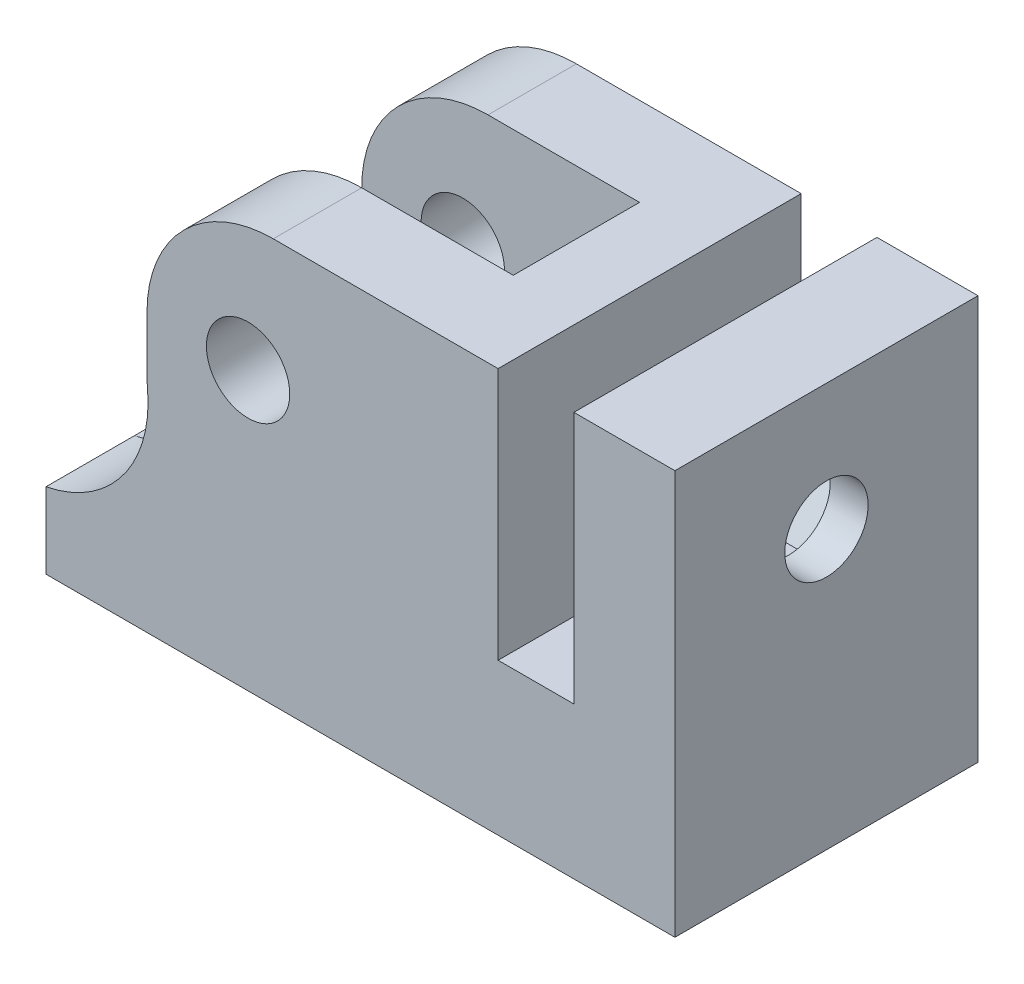
ISO-10303-21;
HEADER;
FILE_DESCRIPTION(('STEP AP214'),'2;1');
FILE_NAME('part.step','',(''),(''),'','','');
FILE_SCHEMA(('AUTOMOTIVE_DESIGN { 1 0 10303 214 1 1 1 1 }'));
ENDSEC;
DATA;
#1=APPLICATION_CONTEXT('core data for automotive mechanical design processes');
#2=APPLICATION_PROTOCOL_DEFINITION('international standard','automotive_design',2000,#1);
#3=PRODUCT_CONTEXT('',#1,'mechanical');
#4=PRODUCT('Part','Part','',(#3));
#5=PRODUCT_RELATED_PRODUCT_CATEGORY('part','',(#4));
#6=PRODUCT_DEFINITION_FORMATION('','',#4);
#7=PRODUCT_DEFINITION_CONTEXT('part definition',#1,'design');
#8=PRODUCT_DEFINITION('design','',#6,#7);
#9=PRODUCT_DEFINITION_SHAPE('','',#8);
#10=(LENGTH_UNIT() NAMED_UNIT(*) SI_UNIT(.MILLI.,.METRE.));
#11=(NAMED_UNIT(*) PLANE_ANGLE_UNIT() SI_UNIT($,.RADIAN.));
#12=(NAMED_UNIT(*) SI_UNIT($,.STERADIAN.) SOLID_ANGLE_UNIT());
#13=UNCERTAINTY_MEASURE_WITH_UNIT(LENGTH_MEASURE(1.E-05),#10,'distance_accuracy_value','');
#14=(GEOMETRIC_REPRESENTATION_CONTEXT(3) GLOBAL_UNCERTAINTY_ASSIGNED_CONTEXT((#13)) GLOBAL_UNIT_ASSIGNED_CONTEXT((#10,
#11,#12)) REPRESENTATION_CONTEXT('',''));
#15=CARTESIAN_POINT('',(0.,0.,0.));
#16=DIRECTION('',(0.,0.,1.));
#17=DIRECTION('',(1.,0.,0.));
#18=AXIS2_PLACEMENT_3D('',#15,#16,#17);
#19=CARTESIAN_POINT('',(-13.9,0.,12.));
#20=DIRECTION('',(1.,0.,0.));
#21=DIRECTION('',(0.,1.,0.));
#22=AXIS2_PLACEMENT_3D('',#19,#20,#21);
#23=PLANE('',#22);
#24=DIRECTION('',(0.,1.,0.));
#25=VECTOR('',#24,1.);
#26=CARTESIAN_POINT('',(-13.9,-16.,8.5));
#27=LINE('',#26,#25);
#28=CARTESIAN_POINT('',(-13.9,-7.18370261164402,8.5));
#29=VERTEX_POINT('',#28);
#30=CARTESIAN_POINT('',(-13.9,-5.,8.5));
#31=VERTEX_POINT('',#30);
#32=EDGE_CURVE('E383',#29,#31,#27,.T.);
#33=ORIENTED_EDGE('',*,*,#32,.F.);
#34=DIRECTION('',(0.,0.,-1.));
#35=VECTOR('',#34,1.);
#36=CARTESIAN_POINT('',(-13.9,-7.18370261164402,12.));
#37=LINE('',#36,#35);
#38=CARTESIAN_POINT('',(-13.9,-7.18370261164402,12.));
#39=VERTEX_POINT('',#38);
#40=EDGE_CURVE('E486',#29,#39,#37,.F.);
#41=ORIENTED_EDGE('',*,*,#40,.T.);
#42=DIRECTION('',(0.,-1.,0.));
#43=VECTOR('',#42,1.);
#44=CARTESIAN_POINT('',(-13.9,0.,12.));
#45=LINE('',#44,#43);
#46=CARTESIAN_POINT('',(-13.9,-5.,12.));
#47=VERTEX_POINT('',#46);
#48=EDGE_CURVE('E407',#47,#39,#45,.T.);
#49=ORIENTED_EDGE('',*,*,#48,.F.);
#50=DIRECTION('',(0.,0.,-1.));
#51=VECTOR('',#50,1.);
#52=CARTESIAN_POINT('',(-13.9,-5.,12.));
#53=LINE('',#52,#51);
#54=EDGE_CURVE('E483',#47,#31,#53,.T.);
#55=ORIENTED_EDGE('',*,*,#54,.T.);
#56=EDGE_LOOP('',(#33,#41,#49,#55));
#57=FACE_BOUND('',#56,.T.);
#58=ADVANCED_FACE('F33',(#57),#23,.F.);
#59=CARTESIAN_POINT('',(-9.9,-5.,12.));
#60=DIRECTION('',(0.,0.,-1.));
#61=DIRECTION('',(-1.,0.,0.));
#62=AXIS2_PLACEMENT_3D('',#59,#60,#61);
#63=CYLINDRICAL_SURFACE('',#62,1.65);
#64=CARTESIAN_POINT('',(-9.9,-5.,8.5));
#65=DIRECTION('',(0.,0.,1.));
#66=DIRECTION('',(1.,0.,0.));
#67=AXIS2_PLACEMENT_3D('',#64,#65,#66);
#68=CIRCLE('',#67,1.65);
#69=CARTESIAN_POINT('',(-8.25,-5.,8.5));
#70=VERTEX_POINT('',#69);
#71=EDGE_CURVE('E392',#70,#70,#68,.T.);
#72=ORIENTED_EDGE('',*,*,#71,.F.);
#73=EDGE_LOOP('',(#72));
#74=FACE_BOUND('',#73,.T.);
#75=CARTESIAN_POINT('',(-9.9,-5.,12.));
#76=DIRECTION('',(0.,0.,1.));
#77=DIRECTION('',(1.,0.,0.));
#78=AXIS2_PLACEMENT_3D('',#75,#76,#77);
#79=CIRCLE('',#78,1.65);
#80=CARTESIAN_POINT('',(-8.25,-5.,12.));
#81=VERTEX_POINT('',#80);
#82=EDGE_CURVE('E393',#81,#81,#79,.T.);
#83=ORIENTED_EDGE('',*,*,#82,.T.);
#84=EDGE_LOOP('',(#83));
#85=FACE_BOUND('',#84,.T.);
#86=ADVANCED_FACE('F611',(#74,#85),#63,.F.);
#87=CARTESIAN_POINT('',(0.,0.,12.));
#88=DIRECTION('',(0.,0.,1.));
#89=DIRECTION('',(1.,0.,0.));
#90=AXIS2_PLACEMENT_3D('',#87,#88,#89);
#91=PLANE('',#90);
#92=CARTESIAN_POINT('',(-8.9,-7.18370261164402,12.));
#93=DIRECTION('',(0.,0.,1.));
#94=DIRECTION('',(1.,0.,0.));
#95=AXIS2_PLACEMENT_3D('',#92,#93,#94);
#96=CIRCLE('',#95,5.);
#97=CARTESIAN_POINT('',(-13.8792979238961,-7.63822674200854,12.));
#98=VERTEX_POINT('',#97);
#99=EDGE_CURVE('E468',#39,#98,#96,.T.);
#100=ORIENTED_EDGE('',*,*,#99,.T.);
#101=CARTESIAN_POINT('',(-18.8585958477923,-8.09275087237306,12.));
#102=DIRECTION('',(0.,0.,1.));
#103=DIRECTION('',(1.,0.,0.));
#104=AXIS2_PLACEMENT_3D('',#101,#102,#103);
#105=CIRCLE('',#104,5.);
#106=CARTESIAN_POINT('',(-17.9,-13.,12.));
#107=VERTEX_POINT('',#106);
#108=EDGE_CURVE('E41',#98,#107,#105,.F.);
#109=ORIENTED_EDGE('',*,*,#108,.T.);
#110=DIRECTION('',(0.,-1.,0.));
#111=VECTOR('',#110,1.);
#112=CARTESIAN_POINT('',(-17.9,-13.,12.));
#113=LINE('',#112,#111);
#114=CARTESIAN_POINT('',(-17.9,-16.,12.));
#115=VERTEX_POINT('',#114);
#116=EDGE_CURVE('E294',#107,#115,#113,.T.);
#117=ORIENTED_EDGE('',*,*,#116,.T.);
#118=DIRECTION('',(1.,0.,0.));
#119=VECTOR('',#118,1.);
#120=CARTESIAN_POINT('',(-4.,-16.,12.));
#121=LINE('',#120,#119);
#122=CARTESIAN_POINT('',(7.,-16.,12.));
#123=VERTEX_POINT('',#122);
#124=EDGE_CURVE('E410',#115,#123,#121,.T.);
#125=ORIENTED_EDGE('',*,*,#124,.T.);
#126=DIRECTION('',(0.,1.,0.));
#127=VECTOR('',#126,1.);
#128=CARTESIAN_POINT('',(7.,-16.,12.));
#129=LINE('',#128,#127);
#130=CARTESIAN_POINT('',(7.,0.,12.));
#131=VERTEX_POINT('',#130);
#132=EDGE_CURVE('E412',#123,#131,#129,.T.);
#133=ORIENTED_EDGE('',*,*,#132,.T.);
#134=DIRECTION('',(-1.,0.,0.));
#135=VECTOR('',#134,1.);
#136=CARTESIAN_POINT('',(7.,0.,12.));
#137=LINE('',#136,#135);
#138=CARTESIAN_POINT('',(3.,0.,12.));
#139=VERTEX_POINT('',#138);
#140=EDGE_CURVE('E414',#131,#139,#137,.T.);
#141=ORIENTED_EDGE('',*,*,#140,.T.);
#142=DIRECTION('',(0.,-1.,0.));
#143=VECTOR('',#142,1.);
#144=CARTESIAN_POINT('',(3.,0.,12.));
#145=LINE('',#144,#143);
#146=CARTESIAN_POINT('',(3.,-10.,12.));
#147=VERTEX_POINT('',#146);
#148=EDGE_CURVE('E416',#139,#147,#145,.T.);
#149=ORIENTED_EDGE('',*,*,#148,.T.);
#150=DIRECTION('',(-1.,0.,0.));
#151=VECTOR('',#150,1.);
#152=CARTESIAN_POINT('',(3.,-10.,12.));
#153=LINE('',#152,#151);
#154=CARTESIAN_POINT('',(0.,-10.,12.));
#155=VERTEX_POINT('',#154);
#156=EDGE_CURVE('E418',#147,#155,#153,.T.);
#157=ORIENTED_EDGE('',*,*,#156,.T.);
#158=DIRECTION('',(0.,1.,0.));
#159=VECTOR('',#158,1.);
#160=CARTESIAN_POINT('',(0.,-10.,12.));
#161=LINE('',#160,#159);
#162=CARTESIAN_POINT('',(0.,0.,12.));
#163=VERTEX_POINT('',#162);
#164=EDGE_CURVE('E400',#155,#163,#161,.T.);
#165=ORIENTED_EDGE('',*,*,#164,.T.);
#166=DIRECTION('',(-1.,0.,0.));
#167=VECTOR('',#166,1.);
#168=CARTESIAN_POINT('',(0.,0.,12.));
#169=LINE('',#168,#167);
#170=CARTESIAN_POINT('',(-8.9,0.,12.));
#171=VERTEX_POINT('',#170);
#172=EDGE_CURVE('E403',#163,#171,#169,.T.);
#173=ORIENTED_EDGE('',*,*,#172,.T.);
#174=CARTESIAN_POINT('',(-8.9,-5.,12.));
#175=DIRECTION('',(0.,0.,1.));
#176=DIRECTION('',(1.,0.,0.));
#177=AXIS2_PLACEMENT_3D('',#174,#175,#176);
#178=CIRCLE('',#177,5.);
#179=EDGE_CURVE('E466',#171,#47,#178,.T.);
#180=ORIENTED_EDGE('',*,*,#179,.T.);
#181=ORIENTED_EDGE('',*,*,#48,.T.);
#182=EDGE_LOOP('',(#100,#109,#117,#125,#133,#141,#149,#157,#165,#173,#180,#181));
#183=FACE_BOUND('',#182,.T.);
#184=ORIENTED_EDGE('',*,*,#82,.F.);
#185=EDGE_LOOP('',(#184));
#186=FACE_BOUND('',#185,.T.);
#187=ADVANCED_FACE('F506',(#183,#186),#91,.T.);
#188=CARTESIAN_POINT('',(0.,0.,0.));
#189=DIRECTION('',(0.,0.,1.));
#190=DIRECTION('',(1.,0.,0.));
#191=AXIS2_PLACEMENT_3D('',#188,#189,#190);
#192=PLANE('',#191);
#193=DIRECTION('',(0.,-1.,0.));
#194=VECTOR('',#193,1.);
#195=CARTESIAN_POINT('',(-5.4,-13.,0.));
#196=LINE('',#195,#194);
#197=CARTESIAN_POINT('',(-5.4,-15.1515151515152,0.));
#198=VERTEX_POINT('',#197);
#199=CARTESIAN_POINT('',(-5.4,-16.,0.));
#200=VERTEX_POINT('',#199);
#201=EDGE_CURVE('E298',#198,#200,#196,.T.);
#202=ORIENTED_EDGE('',*,*,#201,.F.);
#203=DIRECTION('',(0.855197831554018,-0.518301716093344,0.));
#204=VECTOR('',#203,1.);
#205=CARTESIAN_POINT('',(-13.9,-10.,0.));
#206=LINE('',#205,#204);
#207=CARTESIAN_POINT('',(-11.4915085804667,-11.4596917694141,0.));
#208=VERTEX_POINT('',#207);
#209=EDGE_CURVE('E429',#208,#198,#206,.T.);
#210=ORIENTED_EDGE('',*,*,#209,.F.);
#211=CARTESIAN_POINT('',(-8.9,-7.18370261164402,0.));
#212=DIRECTION('',(0.,0.,1.));
#213=DIRECTION('',(1.,0.,0.));
#214=AXIS2_PLACEMENT_3D('',#211,#212,#213);
#215=CIRCLE('',#214,5.);
#216=CARTESIAN_POINT('',(-13.9,-7.18370261164402,0.));
#217=VERTEX_POINT('',#216);
#218=EDGE_CURVE('E473',#208,#217,#215,.F.);
#219=ORIENTED_EDGE('',*,*,#218,.T.);
#220=DIRECTION('',(0.,-1.,0.));
#221=VECTOR('',#220,1.);
#222=CARTESIAN_POINT('',(-13.9,0.,0.));
#223=LINE('',#222,#221);
#224=CARTESIAN_POINT('',(-13.9,-5.,0.));
#225=VERTEX_POINT('',#224);
#226=EDGE_CURVE('E426',#225,#217,#223,.T.);
#227=ORIENTED_EDGE('',*,*,#226,.F.);
#228=CARTESIAN_POINT('',(-8.9,-5.,0.));
#229=DIRECTION('',(0.,0.,1.));
#230=DIRECTION('',(1.,0.,0.));
#231=AXIS2_PLACEMENT_3D('',#228,#229,#230);
#232=CIRCLE('',#231,5.);
#233=CARTESIAN_POINT('',(-8.9,0.,0.));
#234=VERTEX_POINT('',#233);
#235=EDGE_CURVE('E471',#225,#234,#232,.F.);
#236=ORIENTED_EDGE('',*,*,#235,.T.);
#237=DIRECTION('',(-1.,0.,0.));
#238=VECTOR('',#237,1.);
#239=CARTESIAN_POINT('',(0.,0.,0.));
#240=LINE('',#239,#238);
#241=CARTESIAN_POINT('',(0.,0.,0.));
#242=VERTEX_POINT('',#241);
#243=EDGE_CURVE('E423',#242,#234,#240,.T.);
#244=ORIENTED_EDGE('',*,*,#243,.F.);
#245=DIRECTION('',(0.,1.,0.));
#246=VECTOR('',#245,1.);
#247=CARTESIAN_POINT('',(0.,-10.,0.));
#248=LINE('',#247,#246);
#249=CARTESIAN_POINT('',(0.,-10.,0.));
#250=VERTEX_POINT('',#249);
#251=EDGE_CURVE('E396',#250,#242,#248,.T.);
#252=ORIENTED_EDGE('',*,*,#251,.F.);
#253=DIRECTION('',(-1.,0.,0.));
#254=VECTOR('',#253,1.);
#255=CARTESIAN_POINT('',(3.,-10.,0.));
#256=LINE('',#255,#254);
#257=CARTESIAN_POINT('',(3.,-10.,0.));
#258=VERTEX_POINT('',#257);
#259=EDGE_CURVE('E404',#258,#250,#256,.T.);
#260=ORIENTED_EDGE('',*,*,#259,.F.);
#261=DIRECTION('',(0.,-1.,0.));
#262=VECTOR('',#261,1.);
#263=CARTESIAN_POINT('',(3.,0.,0.));
#264=LINE('',#263,#262);
#265=CARTESIAN_POINT('',(3.,0.,0.));
#266=VERTEX_POINT('',#265);
#267=EDGE_CURVE('E438',#266,#258,#264,.T.);
#268=ORIENTED_EDGE('',*,*,#267,.F.);
#269=DIRECTION('',(-1.,0.,0.));
#270=VECTOR('',#269,1.);
#271=CARTESIAN_POINT('',(7.,0.,0.));
#272=LINE('',#271,#270);
#273=CARTESIAN_POINT('',(7.,0.,0.));
#274=VERTEX_POINT('',#273);
#275=EDGE_CURVE('E436',#274,#266,#272,.T.);
#276=ORIENTED_EDGE('',*,*,#275,.F.);
#277=DIRECTION('',(0.,1.,0.));
#278=VECTOR('',#277,1.);
#279=CARTESIAN_POINT('',(7.,-16.,0.));
#280=LINE('',#279,#278);
#281=CARTESIAN_POINT('',(7.,-16.,0.));
#282=VERTEX_POINT('',#281);
#283=EDGE_CURVE('E434',#282,#274,#280,.T.);
#284=ORIENTED_EDGE('',*,*,#283,.F.);
#285=DIRECTION('',(1.,0.,0.));
#286=VECTOR('',#285,1.);
#287=CARTESIAN_POINT('',(-4.,-16.,0.));
#288=LINE('',#287,#286);
#289=EDGE_CURVE('E432',#200,#282,#288,.T.);
#290=ORIENTED_EDGE('',*,*,#289,.F.);
#291=EDGE_LOOP('',(#202,#210,#219,#227,#236,#244,#252,#260,#268,#276,#284,#290));
#292=FACE_BOUND('',#291,.T.);
#293=CARTESIAN_POINT('',(-9.9,-5.,0.));
#294=DIRECTION('',(0.,0.,1.));
#295=DIRECTION('',(1.,0.,0.));
#296=AXIS2_PLACEMENT_3D('',#293,#294,#295);
#297=CIRCLE('',#296,1.65);
#298=CARTESIAN_POINT('',(-8.25,-5.,0.));
#299=VERTEX_POINT('',#298);
#300=EDGE_CURVE('E397',#299,#299,#297,.T.);
#301=ORIENTED_EDGE('',*,*,#300,.T.);
#302=EDGE_LOOP('',(#301));
#303=FACE_BOUND('',#302,.T.);
#304=ADVANCED_FACE('F543',(#292,#303),#192,.F.);
#305=CARTESIAN_POINT('',(0.,-10.,12.));
#306=DIRECTION('',(-1.,0.,0.));
#307=DIRECTION('',(0.,0.,1.));
#308=AXIS2_PLACEMENT_3D('',#305,#306,#307);
#309=PLANE('',#308);
#310=ORIENTED_EDGE('',*,*,#251,.T.);
#311=DIRECTION('',(0.,0.,-1.));
#312=VECTOR('',#311,1.);
#313=CARTESIAN_POINT('',(0.,0.,12.));
#314=LINE('',#313,#312);
#315=EDGE_CURVE('E455',#163,#242,#314,.T.);
#316=ORIENTED_EDGE('',*,*,#315,.F.);
#317=ORIENTED_EDGE('',*,*,#164,.F.);
#318=DIRECTION('',(0.,0.,-1.));
#319=VECTOR('',#318,1.);
#320=CARTESIAN_POINT('',(0.,-10.,12.));
#321=LINE('',#320,#319);
#322=EDGE_CURVE('E420',#155,#250,#321,.T.);
#323=ORIENTED_EDGE('',*,*,#322,.T.);
#324=EDGE_LOOP('',(#310,#316,#317,#323));
#325=FACE_BOUND('',#324,.T.);
#326=ADVANCED_FACE('F588',(#325),#309,.F.);
#327=CARTESIAN_POINT('',(0.,0.,12.));
#328=DIRECTION('',(0.,-1.,0.));
#329=DIRECTION('',(1.,0.,0.));
#330=AXIS2_PLACEMENT_3D('',#327,#328,#329);
#331=PLANE('',#330);
#332=ORIENTED_EDGE('',*,*,#243,.T.);
#333=DIRECTION('',(0.,0.,-1.));
#334=VECTOR('',#333,1.);
#335=CARTESIAN_POINT('',(-8.9,0.,12.));
#336=LINE('',#335,#334);
#337=CARTESIAN_POINT('',(-8.9,0.,3.5));
#338=VERTEX_POINT('',#337);
#339=EDGE_CURVE('E495',#234,#338,#336,.F.);
#340=ORIENTED_EDGE('',*,*,#339,.T.);
#341=DIRECTION('',(-1.,0.,0.));
#342=VECTOR('',#341,1.);
#343=CARTESIAN_POINT('',(-13.9,0.,3.5));
#344=LINE('',#343,#342);
#345=CARTESIAN_POINT('',(-2.9,0.,3.5));
#346=VERTEX_POINT('',#345);
#347=EDGE_CURVE('E373',#346,#338,#344,.T.);
#348=ORIENTED_EDGE('',*,*,#347,.F.);
#349=DIRECTION('',(0.,0.,-1.));
#350=VECTOR('',#349,1.);
#351=CARTESIAN_POINT('',(-2.9,0.,3.5));
#352=LINE('',#351,#350);
#353=CARTESIAN_POINT('',(-2.9,0.,8.5));
#354=VERTEX_POINT('',#353);
#355=EDGE_CURVE('E360',#354,#346,#352,.T.);
#356=ORIENTED_EDGE('',*,*,#355,.F.);
#357=DIRECTION('',(1.,0.,0.));
#358=VECTOR('',#357,1.);
#359=CARTESIAN_POINT('',(-13.9,0.,8.5));
#360=LINE('',#359,#358);
#361=CARTESIAN_POINT('',(-8.9,0.,8.5));
#362=VERTEX_POINT('',#361);
#363=EDGE_CURVE('E376',#362,#354,#360,.T.);
#364=ORIENTED_EDGE('',*,*,#363,.F.);
#365=DIRECTION('',(0.,0.,-1.));
#366=VECTOR('',#365,1.);
#367=CARTESIAN_POINT('',(-8.9,0.,12.));
#368=LINE('',#367,#366);
#369=EDGE_CURVE('E493',#362,#171,#368,.F.);
#370=ORIENTED_EDGE('',*,*,#369,.T.);
#371=ORIENTED_EDGE('',*,*,#172,.F.);
#372=ORIENTED_EDGE('',*,*,#315,.T.);
#373=EDGE_LOOP('',(#332,#340,#348,#356,#364,#370,#371,#372));
#374=FACE_BOUND('',#373,.T.);
#375=ADVANCED_FACE('F526',(#374),#331,.F.);
#376=ORIENTED_EDGE('',*,*,#226,.T.);
#377=DIRECTION('',(0.,0.,-1.));
#378=VECTOR('',#377,1.);
#379=CARTESIAN_POINT('',(-13.9,-7.18370261164402,12.));
#380=LINE('',#379,#378);
#381=CARTESIAN_POINT('',(-13.9,-7.18370261164402,3.5));
#382=VERTEX_POINT('',#381);
#383=EDGE_CURVE('E491',#217,#382,#380,.F.);
#384=ORIENTED_EDGE('',*,*,#383,.T.);
#385=DIRECTION('',(0.,1.,0.));
#386=VECTOR('',#385,1.);
#387=CARTESIAN_POINT('',(-13.9,-16.,3.5));
#388=LINE('',#387,#386);
#389=CARTESIAN_POINT('',(-13.9,-5.,3.5));
#390=VERTEX_POINT('',#389);
#391=EDGE_CURVE('E386',#382,#390,#388,.T.);
#392=ORIENTED_EDGE('',*,*,#391,.T.);
#393=DIRECTION('',(0.,0.,-1.));
#394=VECTOR('',#393,1.);
#395=CARTESIAN_POINT('',(-13.9,-5.,12.));
#396=LINE('',#395,#394);
#397=EDGE_CURVE('E488',#390,#225,#396,.T.);
#398=ORIENTED_EDGE('',*,*,#397,.T.);
#399=EDGE_LOOP('',(#376,#384,#392,#398));
#400=FACE_BOUND('',#399,.T.);
#401=ADVANCED_FACE('F597',(#400),#23,.F.);
#402=CARTESIAN_POINT('',(-13.9,-10.,12.));
#403=DIRECTION('',(0.518301716093344,0.855197831554018,0.));
#404=DIRECTION('',(-0.855197831554018,0.518301716093344,0.));
#405=AXIS2_PLACEMENT_3D('',#402,#403,#404);
#406=PLANE('',#405);
#407=ORIENTED_EDGE('',*,*,#209,.T.);
#408=DIRECTION('',(0.,0.,1.));
#409=VECTOR('',#408,1.);
#410=CARTESIAN_POINT('',(-5.4,-15.1515151515152,12.));
#411=LINE('',#410,#409);
#412=CARTESIAN_POINT('',(-5.4,-15.1515151515152,3.5));
#413=VERTEX_POINT('',#412);
#414=EDGE_CURVE('E313',#198,#413,#411,.T.);
#415=ORIENTED_EDGE('',*,*,#414,.T.);
#416=DIRECTION('',(-0.855197831554018,0.518301716093344,0.));
#417=VECTOR('',#416,1.);
#418=CARTESIAN_POINT('',(-13.9,-10.,3.5));
#419=LINE('',#418,#417);
#420=CARTESIAN_POINT('',(-11.4915085804667,-11.4596917694141,3.5));
#421=VERTEX_POINT('',#420);
#422=EDGE_CURVE('E390',#413,#421,#419,.T.);
#423=ORIENTED_EDGE('',*,*,#422,.T.);
#424=DIRECTION('',(0.,0.,-1.));
#425=VECTOR('',#424,1.);
#426=CARTESIAN_POINT('',(-11.4915085804667,-11.4596917694141,12.));
#427=LINE('',#426,#425);
#428=EDGE_CURVE('E475',#421,#208,#427,.T.);
#429=ORIENTED_EDGE('',*,*,#428,.T.);
#430=EDGE_LOOP('',(#407,#415,#423,#429));
#431=FACE_BOUND('',#430,.T.);
#432=ADVANCED_FACE('F539',(#431),#406,.F.);
#433=CARTESIAN_POINT('',(-4.,-16.,12.));
#434=DIRECTION('',(0.,1.,0.));
#435=DIRECTION('',(0.,0.,1.));
#436=AXIS2_PLACEMENT_3D('',#433,#434,#435);
#437=PLANE('',#436);
#438=ORIENTED_EDGE('',*,*,#124,.F.);
#439=DIRECTION('',(0.,0.,-1.));
#440=VECTOR('',#439,1.);
#441=CARTESIAN_POINT('',(-17.9,-16.,12.));
#442=LINE('',#441,#440);
#443=CARTESIAN_POINT('',(-17.9,-16.,0.));
#444=VERTEX_POINT('',#443);
#445=EDGE_CURVE('E277',#115,#444,#442,.T.);
#446=ORIENTED_EDGE('',*,*,#445,.T.);
#447=DIRECTION('',(1.,0.,0.));
#448=VECTOR('',#447,1.);
#449=CARTESIAN_POINT('',(-17.9,-16.,0.));
#450=LINE('',#449,#448);
#451=CARTESIAN_POINT('',(-14.4,-16.,0.));
#452=VERTEX_POINT('',#451);
#453=EDGE_CURVE('E253',#444,#452,#450,.T.);
#454=ORIENTED_EDGE('',*,*,#453,.T.);
#455=DIRECTION('',(0.,0.,1.));
#456=VECTOR('',#455,1.);
#457=CARTESIAN_POINT('',(-14.4,-16.,0.));
#458=LINE('',#457,#456);
#459=CARTESIAN_POINT('',(-14.4,-16.,4.5));
#460=VERTEX_POINT('',#459);
#461=EDGE_CURVE('E280',#452,#460,#458,.T.);
#462=ORIENTED_EDGE('',*,*,#461,.T.);
#463=CARTESIAN_POINT('',(-14.4,-16.,6.));
#464=DIRECTION('',(0.,1.,0.));
#465=DIRECTION('',(0.,0.,1.));
#466=AXIS2_PLACEMENT_3D('',#463,#464,#465);
#467=CIRCLE('',#466,1.5);
#468=CARTESIAN_POINT('',(-14.4,-16.,7.5));
#469=VERTEX_POINT('',#468);
#470=EDGE_CURVE('E283',#460,#469,#467,.T.);
#471=ORIENTED_EDGE('',*,*,#470,.T.);
#472=DIRECTION('',(1.,0.,0.));
#473=VECTOR('',#472,1.);
#474=CARTESIAN_POINT('',(-14.4,-16.,7.5));
#475=LINE('',#474,#473);
#476=CARTESIAN_POINT('',(-5.4,-16.,7.5));
#477=VERTEX_POINT('',#476);
#478=EDGE_CURVE('E286',#469,#477,#475,.T.);
#479=ORIENTED_EDGE('',*,*,#478,.T.);
#480=CARTESIAN_POINT('',(-5.4,-16.,6.));
#481=DIRECTION('',(0.,1.,0.));
#482=DIRECTION('',(0.,0.,1.));
#483=AXIS2_PLACEMENT_3D('',#480,#481,#482);
#484=CIRCLE('',#483,1.5);
#485=CARTESIAN_POINT('',(-5.4,-16.,4.5));
#486=VERTEX_POINT('',#485);
#487=EDGE_CURVE('E289',#477,#486,#484,.T.);
#488=ORIENTED_EDGE('',*,*,#487,.T.);
#489=DIRECTION('',(0.,0.,-1.));
#490=VECTOR('',#489,1.);
#491=CARTESIAN_POINT('',(-5.4,-16.,4.5));
#492=LINE('',#491,#490);
#493=EDGE_CURVE('E246',#486,#200,#492,.T.);
#494=ORIENTED_EDGE('',*,*,#493,.T.);
#495=ORIENTED_EDGE('',*,*,#289,.T.);
#496=DIRECTION('',(0.,0.,-1.));
#497=VECTOR('',#496,1.);
#498=CARTESIAN_POINT('',(7.,-16.,12.));
#499=LINE('',#498,#497);
#500=EDGE_CURVE('E452',#123,#282,#499,.T.);
#501=ORIENTED_EDGE('',*,*,#500,.F.);
#502=EDGE_LOOP('',(#438,#446,#454,#462,#471,#479,#488,#494,#495,#501));
#503=FACE_BOUND('',#502,.T.);
#504=ADVANCED_FACE('F549',(#503),#437,.F.);
#505=CARTESIAN_POINT('',(7.,-16.,12.));
#506=DIRECTION('',(-1.,0.,0.));
#507=DIRECTION('',(0.,-1.,0.));
#508=AXIS2_PLACEMENT_3D('',#505,#506,#507);
#509=PLANE('',#508);
#510=CARTESIAN_POINT('',(7.,-5.,6.));
#511=DIRECTION('',(-1.,0.,0.));
#512=DIRECTION('',(0.,-1.,0.));
#513=AXIS2_PLACEMENT_3D('',#510,#511,#512);
#514=CIRCLE('',#513,1.65);
#515=CARTESIAN_POINT('',(7.,-6.65,6.));
#516=VERTEX_POINT('',#515);
#517=EDGE_CURVE('E316',#516,#516,#514,.T.);
#518=ORIENTED_EDGE('',*,*,#517,.T.);
#519=EDGE_LOOP('',(#518));
#520=FACE_BOUND('',#519,.T.);
#521=DIRECTION('',(0.,0.,-1.));
#522=VECTOR('',#521,1.);
#523=CARTESIAN_POINT('',(7.,0.,12.));
#524=LINE('',#523,#522);
#525=EDGE_CURVE('E449',#131,#274,#524,.T.);
#526=ORIENTED_EDGE('',*,*,#525,.F.);
#527=ORIENTED_EDGE('',*,*,#132,.F.);
#528=ORIENTED_EDGE('',*,*,#500,.T.);
#529=ORIENTED_EDGE('',*,*,#283,.T.);
#530=EDGE_LOOP('',(#526,#527,#528,#529));
#531=FACE_BOUND('',#530,.T.);
#532=ADVANCED_FACE('F570',(#520,#531),#509,.F.);
#533=CARTESIAN_POINT('',(7.,0.,12.));
#534=DIRECTION('',(0.,-1.,0.));
#535=DIRECTION('',(1.,0.,0.));
#536=AXIS2_PLACEMENT_3D('',#533,#534,#535);
#537=PLANE('',#536);
#538=ORIENTED_EDGE('',*,*,#275,.T.);
#539=DIRECTION('',(0.,0.,-1.));
#540=VECTOR('',#539,1.);
#541=CARTESIAN_POINT('',(3.,0.,12.));
#542=LINE('',#541,#540);
#543=EDGE_CURVE('E446',#139,#266,#542,.T.);
#544=ORIENTED_EDGE('',*,*,#543,.F.);
#545=ORIENTED_EDGE('',*,*,#140,.F.);
#546=ORIENTED_EDGE('',*,*,#525,.T.);
#547=EDGE_LOOP('',(#538,#544,#545,#546));
#548=FACE_BOUND('',#547,.T.);
#549=ADVANCED_FACE('F573',(#548),#537,.F.);
#550=CARTESIAN_POINT('',(3.,0.,12.));
#551=DIRECTION('',(1.,0.,0.));
#552=DIRECTION('',(0.,1.,0.));
#553=AXIS2_PLACEMENT_3D('',#550,#551,#552);
#554=PLANE('',#553);
#555=DIRECTION('',(0.,-0.866025403784439,0.5));
#556=VECTOR('',#555,1.);
#557=CARTESIAN_POINT('',(3.,-5.,2.53589838486224));
#558=LINE('',#557,#556);
#559=CARTESIAN_POINT('',(3.,-5.,2.53589838486225));
#560=VERTEX_POINT('',#559);
#561=CARTESIAN_POINT('',(3.,-8.,4.26794919243112));
#562=VERTEX_POINT('',#561);
#563=EDGE_CURVE('E344',#560,#562,#558,.T.);
#564=ORIENTED_EDGE('',*,*,#563,.F.);
#565=DIRECTION('',(0.,-0.866025403784439,-0.5));
#566=VECTOR('',#565,1.);
#567=CARTESIAN_POINT('',(3.,-2.,4.26794919243112));
#568=LINE('',#567,#566);
#569=CARTESIAN_POINT('',(3.,-2.,4.26794919243112));
#570=VERTEX_POINT('',#569);
#571=EDGE_CURVE('E322',#570,#560,#568,.T.);
#572=ORIENTED_EDGE('',*,*,#571,.F.);
#573=DIRECTION('',(0.,0.,-1.));
#574=VECTOR('',#573,1.);
#575=CARTESIAN_POINT('',(3.,-2.,7.73205080756888));
#576=LINE('',#575,#574);
#577=CARTESIAN_POINT('',(3.,-2.,7.73205080756888));
#578=VERTEX_POINT('',#577);
#579=EDGE_CURVE('E327',#578,#570,#576,.T.);
#580=ORIENTED_EDGE('',*,*,#579,.F.);
#581=DIRECTION('',(0.,0.866025403784438,-0.5));
#582=VECTOR('',#581,1.);
#583=CARTESIAN_POINT('',(3.,-5.,9.46410161513776));
#584=LINE('',#583,#582);
#585=CARTESIAN_POINT('',(3.,-5.,9.46410161513776));
#586=VERTEX_POINT('',#585);
#587=EDGE_CURVE('E353',#586,#578,#584,.T.);
#588=ORIENTED_EDGE('',*,*,#587,.F.);
#589=DIRECTION('',(0.,0.866025403784438,0.5));
#590=VECTOR('',#589,1.);
#591=CARTESIAN_POINT('',(3.,-8.,7.73205080756888));
#592=LINE('',#591,#590);
#593=CARTESIAN_POINT('',(3.,-8.,7.73205080756888));
#594=VERTEX_POINT('',#593);
#595=EDGE_CURVE('E350',#594,#586,#592,.T.);
#596=ORIENTED_EDGE('',*,*,#595,.F.);
#597=DIRECTION('',(0.,0.,1.));
#598=VECTOR('',#597,1.);
#599=CARTESIAN_POINT('',(3.,-8.,4.26794919243112));
#600=LINE('',#599,#598);
#601=EDGE_CURVE('E347',#562,#594,#600,.T.);
#602=ORIENTED_EDGE('',*,*,#601,.F.);
#603=EDGE_LOOP('',(#564,#572,#580,#588,#596,#602));
#604=FACE_BOUND('',#603,.T.);
#605=ORIENTED_EDGE('',*,*,#267,.T.);
#606=DIRECTION('',(0.,0.,-1.));
#607=VECTOR('',#606,1.);
#608=CARTESIAN_POINT('',(3.,-10.,12.));
#609=LINE('',#608,#607);
#610=EDGE_CURVE('E443',#147,#258,#609,.T.);
#611=ORIENTED_EDGE('',*,*,#610,.F.);
#612=ORIENTED_EDGE('',*,*,#148,.F.);
#613=ORIENTED_EDGE('',*,*,#543,.T.);
#614=EDGE_LOOP('',(#605,#611,#612,#613));
#615=FACE_BOUND('',#614,.T.);
#616=ADVANCED_FACE('F578',(#604,#615),#554,.F.);
#617=CARTESIAN_POINT('',(3.,-10.,12.));
#618=DIRECTION('',(0.,-1.,0.));
#619=DIRECTION('',(0.,0.,-1.));
#620=AXIS2_PLACEMENT_3D('',#617,#618,#619);
#621=PLANE('',#620);
#622=ORIENTED_EDGE('',*,*,#259,.T.);
#623=ORIENTED_EDGE('',*,*,#322,.F.);
#624=ORIENTED_EDGE('',*,*,#156,.F.);
#625=ORIENTED_EDGE('',*,*,#610,.T.);
#626=EDGE_LOOP('',(#622,#623,#624,#625));
#627=FACE_BOUND('',#626,.T.);
#628=ADVANCED_FACE('F584',(#627),#621,.F.);
#629=CARTESIAN_POINT('',(-9.9,-5.,3.5));
#630=DIRECTION('',(0.,0.,-1.));
#631=DIRECTION('',(-1.,0.,0.));
#632=AXIS2_PLACEMENT_3D('',#629,#630,#631);
#633=CIRCLE('',#632,1.65);
#634=CARTESIAN_POINT('',(-11.55,-5.,3.5));
#635=VERTEX_POINT('',#634);
#636=EDGE_CURVE('E382',#635,#635,#633,.T.);
#637=ORIENTED_EDGE('',*,*,#636,.F.);
#638=EDGE_LOOP('',(#637));
#639=FACE_BOUND('',#638,.T.);
#640=ORIENTED_EDGE('',*,*,#300,.F.);
#641=EDGE_LOOP('',(#640));
#642=FACE_BOUND('',#641,.T.);
#643=ADVANCED_FACE('F618',(#639,#642),#63,.F.);
#644=CARTESIAN_POINT('',(-13.9,-16.,8.5));
#645=DIRECTION('',(0.,0.,1.));
#646=DIRECTION('',(1.,0.,0.));
#647=AXIS2_PLACEMENT_3D('',#644,#645,#646);
#648=PLANE('',#647);
#649=ORIENTED_EDGE('',*,*,#71,.T.);
#650=EDGE_LOOP('',(#649));
#651=FACE_BOUND('',#650,.T.);
#652=DIRECTION('',(0.,1.,0.));
#653=VECTOR('',#652,1.);
#654=CARTESIAN_POINT('',(-2.9,-16.,8.5));
#655=LINE('',#654,#653);
#656=CARTESIAN_POINT('',(-2.9,-13.,8.5));
#657=VERTEX_POINT('',#656);
#658=EDGE_CURVE('E380',#657,#354,#655,.T.);
#659=ORIENTED_EDGE('',*,*,#658,.F.);
#660=DIRECTION('',(-1.,0.,0.));
#661=VECTOR('',#660,1.);
#662=CARTESIAN_POINT('',(-13.9,-13.,8.5));
#663=LINE('',#662,#661);
#664=CARTESIAN_POINT('',(-17.9,-13.,8.5));
#665=VERTEX_POINT('',#664);
#666=EDGE_CURVE('E47',#657,#665,#663,.T.);
#667=ORIENTED_EDGE('',*,*,#666,.T.);
#668=CARTESIAN_POINT('',(-18.8585958477923,-8.09275087237306,8.5));
#669=DIRECTION('',(0.,0.,1.));
#670=DIRECTION('',(1.,0.,0.));
#671=AXIS2_PLACEMENT_3D('',#668,#669,#670);
#672=CIRCLE('',#671,5.);
#673=CARTESIAN_POINT('',(-13.8792979238961,-7.63822674200854,8.5));
#674=VERTEX_POINT('',#673);
#675=EDGE_CURVE('E11',#665,#674,#672,.T.);
#676=ORIENTED_EDGE('',*,*,#675,.T.);
#677=CARTESIAN_POINT('',(-8.9,-7.18370261164402,8.5));
#678=DIRECTION('',(0.,0.,1.));
#679=DIRECTION('',(1.,0.,0.));
#680=AXIS2_PLACEMENT_3D('',#677,#678,#679);
#681=CIRCLE('',#680,5.);
#682=EDGE_CURVE('E464',#674,#29,#681,.F.);
#683=ORIENTED_EDGE('',*,*,#682,.T.);
#684=ORIENTED_EDGE('',*,*,#32,.T.);
#685=CARTESIAN_POINT('',(-8.9,-5.,8.5));
#686=DIRECTION('',(0.,0.,1.));
#687=DIRECTION('',(1.,0.,0.));
#688=AXIS2_PLACEMENT_3D('',#685,#686,#687);
#689=CIRCLE('',#688,5.);
#690=EDGE_CURVE('E458',#31,#362,#689,.F.);
#691=ORIENTED_EDGE('',*,*,#690,.T.);
#692=ORIENTED_EDGE('',*,*,#363,.T.);
#693=EDGE_LOOP('',(#659,#667,#676,#683,#684,#691,#692));
#694=FACE_BOUND('',#693,.T.);
#695=ADVANCED_FACE('F515',(#651,#694),#648,.F.);
#696=CARTESIAN_POINT('',(-13.9,-16.,3.5));
#697=DIRECTION('',(0.,0.,-1.));
#698=DIRECTION('',(-1.,0.,0.));
#699=AXIS2_PLACEMENT_3D('',#696,#697,#698);
#700=PLANE('',#699);
#701=ORIENTED_EDGE('',*,*,#636,.T.);
#702=EDGE_LOOP('',(#701));
#703=FACE_BOUND('',#702,.T.);
#704=ORIENTED_EDGE('',*,*,#422,.F.);
#705=DIRECTION('',(0.,1.,0.));
#706=VECTOR('',#705,1.);
#707=CARTESIAN_POINT('',(-5.4,-16.,3.5));
#708=LINE('',#707,#706);
#709=CARTESIAN_POINT('',(-5.4,-13.,3.5));
#710=VERTEX_POINT('',#709);
#711=EDGE_CURVE('E500',#413,#710,#708,.T.);
#712=ORIENTED_EDGE('',*,*,#711,.T.);
#713=DIRECTION('',(1.,0.,0.));
#714=VECTOR('',#713,1.);
#715=CARTESIAN_POINT('',(-13.9,-13.,3.5));
#716=LINE('',#715,#714);
#717=CARTESIAN_POINT('',(-2.9,-13.,3.5));
#718=VERTEX_POINT('',#717);
#719=EDGE_CURVE('E297',#710,#718,#716,.T.);
#720=ORIENTED_EDGE('',*,*,#719,.T.);
#721=DIRECTION('',(0.,1.,0.));
#722=VECTOR('',#721,1.);
#723=CARTESIAN_POINT('',(-2.9,-16.,3.5));
#724=LINE('',#723,#722);
#725=EDGE_CURVE('E379',#718,#346,#724,.T.);
#726=ORIENTED_EDGE('',*,*,#725,.T.);
#727=ORIENTED_EDGE('',*,*,#347,.T.);
#728=CARTESIAN_POINT('',(-8.9,-5.,3.5));
#729=DIRECTION('',(0.,0.,-1.));
#730=DIRECTION('',(-1.,0.,0.));
#731=AXIS2_PLACEMENT_3D('',#728,#729,#730);
#732=CIRCLE('',#731,5.);
#733=EDGE_CURVE('E478',#338,#390,#732,.F.);
#734=ORIENTED_EDGE('',*,*,#733,.T.);
#735=ORIENTED_EDGE('',*,*,#391,.F.);
#736=CARTESIAN_POINT('',(-8.9,-7.18370261164402,3.5));
#737=DIRECTION('',(0.,0.,-1.));
#738=DIRECTION('',(-1.,0.,0.));
#739=AXIS2_PLACEMENT_3D('',#736,#737,#738);
#740=CIRCLE('',#739,5.);
#741=EDGE_CURVE('E480',#382,#421,#740,.F.);
#742=ORIENTED_EDGE('',*,*,#741,.T.);
#743=EDGE_LOOP('',(#704,#712,#720,#726,#727,#734,#735,#742));
#744=FACE_BOUND('',#743,.T.);
#745=ADVANCED_FACE('F534',(#703,#744),#700,.F.);
#746=CARTESIAN_POINT('',(-2.9,-16.,3.5));
#747=DIRECTION('',(1.,0.,0.));
#748=DIRECTION('',(0.,1.,0.));
#749=AXIS2_PLACEMENT_3D('',#746,#747,#748);
#750=PLANE('',#749);
#751=ORIENTED_EDGE('',*,*,#725,.F.);
#752=DIRECTION('',(0.,0.,1.));
#753=VECTOR('',#752,1.);
#754=CARTESIAN_POINT('',(-2.9,-13.,3.5));
#755=LINE('',#754,#753);
#756=EDGE_CURVE('E497',#718,#657,#755,.T.);
#757=ORIENTED_EDGE('',*,*,#756,.T.);
#758=ORIENTED_EDGE('',*,*,#658,.T.);
#759=ORIENTED_EDGE('',*,*,#355,.T.);
#760=EDGE_LOOP('',(#751,#757,#758,#759));
#761=FACE_BOUND('',#760,.T.);
#762=ADVANCED_FACE('F530',(#761),#750,.F.);
#763=CARTESIAN_POINT('',(-8.9,-7.18370261164402,12.));
#764=DIRECTION('',(0.,0.,-1.));
#765=DIRECTION('',(-1.,0.,0.));
#766=AXIS2_PLACEMENT_3D('',#763,#764,#765);
#767=CYLINDRICAL_SURFACE('',#766,5.);
#768=ORIENTED_EDGE('',*,*,#682,.F.);
#769=DIRECTION('',(0.,0.,-1.));
#770=VECTOR('',#769,1.);
#771=CARTESIAN_POINT('',(-13.8792979238961,-7.63822674200854,12.));
#772=LINE('',#771,#770);
#773=EDGE_CURVE('E503',#674,#98,#772,.F.);
#774=ORIENTED_EDGE('',*,*,#773,.T.);
#775=ORIENTED_EDGE('',*,*,#99,.F.);
#776=ORIENTED_EDGE('',*,*,#40,.F.);
#777=EDGE_LOOP('',(#768,#774,#775,#776));
#778=FACE_BOUND('',#777,.T.);
#779=ADVANCED_FACE('F512',(#778),#767,.T.);
#780=CARTESIAN_POINT('',(-8.9,-7.18370261164402,12.));
#781=DIRECTION('',(0.,0.,-1.));
#782=DIRECTION('',(-1.,0.,0.));
#783=AXIS2_PLACEMENT_3D('',#780,#781,#782);
#784=CYLINDRICAL_SURFACE('',#783,5.);
#785=ORIENTED_EDGE('',*,*,#741,.F.);
#786=ORIENTED_EDGE('',*,*,#383,.F.);
#787=ORIENTED_EDGE('',*,*,#218,.F.);
#788=ORIENTED_EDGE('',*,*,#428,.F.);
#789=EDGE_LOOP('',(#785,#786,#787,#788));
#790=FACE_BOUND('',#789,.T.);
#791=ADVANCED_FACE('F600',(#790),#784,.T.);
#792=CARTESIAN_POINT('',(-8.9,-5.,12.));
#793=DIRECTION('',(0.,0.,-1.));
#794=DIRECTION('',(-1.,0.,0.));
#795=AXIS2_PLACEMENT_3D('',#792,#793,#794);
#796=CYLINDRICAL_SURFACE('',#795,5.);
#797=ORIENTED_EDGE('',*,*,#733,.F.);
#798=ORIENTED_EDGE('',*,*,#339,.F.);
#799=ORIENTED_EDGE('',*,*,#235,.F.);
#800=ORIENTED_EDGE('',*,*,#397,.F.);
#801=EDGE_LOOP('',(#797,#798,#799,#800));
#802=FACE_BOUND('',#801,.T.);
#803=ADVANCED_FACE('F592',(#802),#796,.T.);
#804=CARTESIAN_POINT('',(-8.9,-5.,12.));
#805=DIRECTION('',(0.,0.,-1.));
#806=DIRECTION('',(-1.,0.,0.));
#807=AXIS2_PLACEMENT_3D('',#804,#805,#806);
#808=CYLINDRICAL_SURFACE('',#807,5.);
#809=ORIENTED_EDGE('',*,*,#179,.F.);
#810=ORIENTED_EDGE('',*,*,#369,.F.);
#811=ORIENTED_EDGE('',*,*,#690,.F.);
#812=ORIENTED_EDGE('',*,*,#54,.F.);
#813=EDGE_LOOP('',(#809,#810,#811,#812));
#814=FACE_BOUND('',#813,.T.);
#815=ADVANCED_FACE('F521',(#814),#808,.T.);
#816=CARTESIAN_POINT('',(5.5,-2.,4.26794919243112));
#817=DIRECTION('',(0.,0.5,-0.866025403784439));
#818=DIRECTION('',(0.,0.866025403784439,0.5));
#819=AXIS2_PLACEMENT_3D('',#816,#817,#818);
#820=PLANE('',#819);
#821=ORIENTED_EDGE('',*,*,#571,.T.);
#822=DIRECTION('',(-1.,0.,0.));
#823=VECTOR('',#822,1.);
#824=CARTESIAN_POINT('',(5.5,-5.,2.53589838486224));
#825=LINE('',#824,#823);
#826=CARTESIAN_POINT('',(5.5,-5.,2.53589838486224));
#827=VERTEX_POINT('',#826);
#828=EDGE_CURVE('E342',#827,#560,#825,.T.);
#829=ORIENTED_EDGE('',*,*,#828,.F.);
#830=DIRECTION('',(0.,-0.866025403784439,-0.5));
#831=VECTOR('',#830,1.);
#832=CARTESIAN_POINT('',(5.5,-2.,4.26794919243112));
#833=LINE('',#832,#831);
#834=CARTESIAN_POINT('',(5.5,-2.,4.26794919243112));
#835=VERTEX_POINT('',#834);
#836=EDGE_CURVE('E323',#835,#827,#833,.T.);
#837=ORIENTED_EDGE('',*,*,#836,.F.);
#838=DIRECTION('',(-1.,0.,0.));
#839=VECTOR('',#838,1.);
#840=CARTESIAN_POINT('',(5.5,-2.,4.26794919243112));
#841=LINE('',#840,#839);
#842=EDGE_CURVE('E358',#835,#570,#841,.T.);
#843=ORIENTED_EDGE('',*,*,#842,.T.);
#844=EDGE_LOOP('',(#821,#829,#837,#843));
#845=FACE_BOUND('',#844,.T.);
#846=ADVANCED_FACE('F823',(#845),#820,.F.);
#847=CARTESIAN_POINT('',(5.5,-2.,7.73205080756888));
#848=DIRECTION('',(0.,1.,0.));
#849=DIRECTION('',(-1.,0.,0.));
#850=AXIS2_PLACEMENT_3D('',#847,#848,#849);
#851=PLANE('',#850);
#852=ORIENTED_EDGE('',*,*,#579,.T.);
#853=ORIENTED_EDGE('',*,*,#842,.F.);
#854=DIRECTION('',(0.,0.,-1.));
#855=VECTOR('',#854,1.);
#856=CARTESIAN_POINT('',(5.5,-2.,7.73205080756888));
#857=LINE('',#856,#855);
#858=CARTESIAN_POINT('',(5.5,-2.,7.73205080756888));
#859=VERTEX_POINT('',#858);
#860=EDGE_CURVE('E339',#859,#835,#857,.T.);
#861=ORIENTED_EDGE('',*,*,#860,.F.);
#862=DIRECTION('',(-1.,0.,0.));
#863=VECTOR('',#862,1.);
#864=CARTESIAN_POINT('',(5.5,-2.,7.73205080756888));
#865=LINE('',#864,#863);
#866=EDGE_CURVE('E361',#859,#578,#865,.T.);
#867=ORIENTED_EDGE('',*,*,#866,.T.);
#868=EDGE_LOOP('',(#852,#853,#861,#867));
#869=FACE_BOUND('',#868,.T.);
#870=ADVANCED_FACE('F815',(#869),#851,.F.);
#871=CARTESIAN_POINT('',(5.5,-5.,9.46410161513776));
#872=DIRECTION('',(0.,0.5,0.866025403784438));
#873=DIRECTION('',(0.,-0.866025403784438,0.5));
#874=AXIS2_PLACEMENT_3D('',#871,#872,#873);
#875=PLANE('',#874);
#876=ORIENTED_EDGE('',*,*,#587,.T.);
#877=ORIENTED_EDGE('',*,*,#866,.F.);
#878=DIRECTION('',(0.,0.866025403784438,-0.5));
#879=VECTOR('',#878,1.);
#880=CARTESIAN_POINT('',(5.5,-5.,9.46410161513776));
#881=LINE('',#880,#879);
#882=CARTESIAN_POINT('',(5.5,-5.,9.46410161513776));
#883=VERTEX_POINT('',#882);
#884=EDGE_CURVE('E336',#883,#859,#881,.T.);
#885=ORIENTED_EDGE('',*,*,#884,.F.);
#886=DIRECTION('',(-1.,0.,0.));
#887=VECTOR('',#886,1.);
#888=CARTESIAN_POINT('',(5.5,-5.,9.46410161513776));
#889=LINE('',#888,#887);
#890=EDGE_CURVE('E363',#883,#586,#889,.T.);
#891=ORIENTED_EDGE('',*,*,#890,.T.);
#892=EDGE_LOOP('',(#876,#877,#885,#891));
#893=FACE_BOUND('',#892,.T.);
#894=ADVANCED_FACE('F807',(#893),#875,.F.);
#895=CARTESIAN_POINT('',(5.5,-8.,7.73205080756888));
#896=DIRECTION('',(0.,-0.5,0.866025403784438));
#897=DIRECTION('',(0.,-0.866025403784438,-0.5));
#898=AXIS2_PLACEMENT_3D('',#895,#896,#897);
#899=PLANE('',#898);
#900=ORIENTED_EDGE('',*,*,#595,.T.);
#901=ORIENTED_EDGE('',*,*,#890,.F.);
#902=DIRECTION('',(0.,0.866025403784438,0.5));
#903=VECTOR('',#902,1.);
#904=CARTESIAN_POINT('',(5.5,-8.,7.73205080756888));
#905=LINE('',#904,#903);
#906=CARTESIAN_POINT('',(5.5,-8.,7.73205080756888));
#907=VERTEX_POINT('',#906);
#908=EDGE_CURVE('E333',#907,#883,#905,.T.);
#909=ORIENTED_EDGE('',*,*,#908,.F.);
#910=DIRECTION('',(-1.,0.,0.));
#911=VECTOR('',#910,1.);
#912=CARTESIAN_POINT('',(5.5,-8.,7.73205080756888));
#913=LINE('',#912,#911);
#914=EDGE_CURVE('E365',#907,#594,#913,.T.);
#915=ORIENTED_EDGE('',*,*,#914,.T.);
#916=EDGE_LOOP('',(#900,#901,#909,#915));
#917=FACE_BOUND('',#916,.T.);
#918=ADVANCED_FACE('F799',(#917),#899,.F.);
#919=CARTESIAN_POINT('',(5.5,-8.,4.26794919243112));
#920=DIRECTION('',(0.,-1.,0.));
#921=DIRECTION('',(0.,0.,-1.));
#922=AXIS2_PLACEMENT_3D('',#919,#920,#921);
#923=PLANE('',#922);
#924=ORIENTED_EDGE('',*,*,#601,.T.);
#925=ORIENTED_EDGE('',*,*,#914,.F.);
#926=DIRECTION('',(0.,0.,1.));
#927=VECTOR('',#926,1.);
#928=CARTESIAN_POINT('',(5.5,-8.,4.26794919243112));
#929=LINE('',#928,#927);
#930=CARTESIAN_POINT('',(5.5,-8.,4.26794919243112));
#931=VERTEX_POINT('',#930);
#932=EDGE_CURVE('E330',#931,#907,#929,.T.);
#933=ORIENTED_EDGE('',*,*,#932,.F.);
#934=DIRECTION('',(-1.,0.,0.));
#935=VECTOR('',#934,1.);
#936=CARTESIAN_POINT('',(5.5,-8.,4.26794919243112));
#937=LINE('',#936,#935);
#938=EDGE_CURVE('E367',#931,#562,#937,.T.);
#939=ORIENTED_EDGE('',*,*,#938,.T.);
#940=EDGE_LOOP('',(#924,#925,#933,#939));
#941=FACE_BOUND('',#940,.T.);
#942=ADVANCED_FACE('F791',(#941),#923,.F.);
#943=CARTESIAN_POINT('',(5.5,-5.,2.53589838486224));
#944=DIRECTION('',(0.,-0.5,-0.866025403784439));
#945=DIRECTION('',(0.,0.866025403784439,-0.5));
#946=AXIS2_PLACEMENT_3D('',#943,#944,#945);
#947=PLANE('',#946);
#948=ORIENTED_EDGE('',*,*,#563,.T.);
#949=ORIENTED_EDGE('',*,*,#938,.F.);
#950=DIRECTION('',(0.,-0.866025403784439,0.5));
#951=VECTOR('',#950,1.);
#952=CARTESIAN_POINT('',(5.5,-5.,2.53589838486224));
#953=LINE('',#952,#951);
#954=EDGE_CURVE('E326',#827,#931,#953,.T.);
#955=ORIENTED_EDGE('',*,*,#954,.F.);
#956=ORIENTED_EDGE('',*,*,#828,.T.);
#957=EDGE_LOOP('',(#948,#949,#955,#956));
#958=FACE_BOUND('',#957,.T.);
#959=ADVANCED_FACE('F783',(#958),#947,.F.);
#960=CARTESIAN_POINT('',(5.5,0.,0.));
#961=DIRECTION('',(-1.,0.,0.));
#962=DIRECTION('',(0.,-1.,0.));
#963=AXIS2_PLACEMENT_3D('',#960,#961,#962);
#964=PLANE('',#963);
#965=CARTESIAN_POINT('',(5.5,-5.,6.));
#966=DIRECTION('',(-1.,0.,0.));
#967=DIRECTION('',(0.,-1.,0.));
#968=AXIS2_PLACEMENT_3D('',#965,#966,#967);
#969=CIRCLE('',#968,1.65);
#970=CARTESIAN_POINT('',(5.5,-6.65,6.));
#971=VERTEX_POINT('',#970);
#972=EDGE_CURVE('E319',#971,#971,#969,.T.);
#973=ORIENTED_EDGE('',*,*,#972,.F.);
#974=EDGE_LOOP('',(#973));
#975=FACE_BOUND('',#974,.T.);
#976=ORIENTED_EDGE('',*,*,#836,.T.);
#977=ORIENTED_EDGE('',*,*,#954,.T.);
#978=ORIENTED_EDGE('',*,*,#932,.T.);
#979=ORIENTED_EDGE('',*,*,#908,.T.);
#980=ORIENTED_EDGE('',*,*,#884,.T.);
#981=ORIENTED_EDGE('',*,*,#860,.T.);
#982=EDGE_LOOP('',(#976,#977,#978,#979,#980,#981));
#983=FACE_BOUND('',#982,.T.);
#984=ADVANCED_FACE('F775',(#975,#983),#964,.T.);
#985=CARTESIAN_POINT('',(7.,-5.,6.));
#986=DIRECTION('',(-1.,0.,0.));
#987=DIRECTION('',(0.,-1.,0.));
#988=AXIS2_PLACEMENT_3D('',#985,#986,#987);
#989=CYLINDRICAL_SURFACE('',#988,1.65);
#990=ORIENTED_EDGE('',*,*,#972,.T.);
#991=EDGE_LOOP('',(#990));
#992=FACE_BOUND('',#991,.T.);
#993=ORIENTED_EDGE('',*,*,#517,.F.);
#994=EDGE_LOOP('',(#993));
#995=FACE_BOUND('',#994,.T.);
#996=ADVANCED_FACE('F766',(#992,#995),#989,.F.);
#997=CARTESIAN_POINT('',(-5.4,-13.,4.5));
#998=DIRECTION('',(-1.,0.,0.));
#999=DIRECTION('',(0.,0.,1.));
#1000=AXIS2_PLACEMENT_3D('',#997,#998,#999);
#1001=PLANE('',#1000);
#1002=ORIENTED_EDGE('',*,*,#414,.F.);
#1003=ORIENTED_EDGE('',*,*,#201,.T.);
#1004=ORIENTED_EDGE('',*,*,#493,.F.);
#1005=DIRECTION('',(0.,-1.,0.));
#1006=VECTOR('',#1005,1.);
#1007=CARTESIAN_POINT('',(-5.4,-13.,4.5));
#1008=LINE('',#1007,#1006);
#1009=CARTESIAN_POINT('',(-5.4,-13.,4.5));
#1010=VERTEX_POINT('',#1009);
#1011=EDGE_CURVE('E301',#1010,#486,#1008,.T.);
#1012=ORIENTED_EDGE('',*,*,#1011,.F.);
#1013=DIRECTION('',(0.,0.,-1.));
#1014=VECTOR('',#1013,1.);
#1015=CARTESIAN_POINT('',(-5.4,-13.,4.5));
#1016=LINE('',#1015,#1014);
#1017=EDGE_CURVE('E256',#1010,#710,#1016,.T.);
#1018=ORIENTED_EDGE('',*,*,#1017,.T.);
#1019=ORIENTED_EDGE('',*,*,#711,.F.);
#1020=EDGE_LOOP('',(#1002,#1003,#1004,#1012,#1018,#1019));
#1021=FACE_BOUND('',#1020,.T.);
#1022=ADVANCED_FACE('F536',(#1021),#1001,.T.);
#1023=CARTESIAN_POINT('',(-14.4,-13.,6.));
#1024=DIRECTION('',(0.,1.,0.));
#1025=DIRECTION('',(0.,0.,1.));
#1026=AXIS2_PLACEMENT_3D('',#1023,#1024,#1025);
#1027=PLANE('',#1026);
#1028=DIRECTION('',(0.,0.,-1.));
#1029=VECTOR('',#1028,1.);
#1030=CARTESIAN_POINT('',(-17.9,-13.,12.));
#1031=LINE('',#1030,#1029);
#1032=CARTESIAN_POINT('',(-17.9,-13.,0.));
#1033=VERTEX_POINT('',#1032);
#1034=EDGE_CURVE('E235',#665,#1033,#1031,.T.);
#1035=ORIENTED_EDGE('',*,*,#1034,.F.);
#1036=ORIENTED_EDGE('',*,*,#666,.F.);
#1037=ORIENTED_EDGE('',*,*,#756,.F.);
#1038=ORIENTED_EDGE('',*,*,#719,.F.);
#1039=ORIENTED_EDGE('',*,*,#1017,.F.);
#1040=CARTESIAN_POINT('',(-5.4,-13.,6.));
#1041=DIRECTION('',(0.,1.,0.));
#1042=DIRECTION('',(0.,0.,1.));
#1043=AXIS2_PLACEMENT_3D('',#1040,#1041,#1042);
#1044=CIRCLE('',#1043,1.5);
#1045=CARTESIAN_POINT('',(-5.4,-13.,7.5));
#1046=VERTEX_POINT('',#1045);
#1047=EDGE_CURVE('E272',#1046,#1010,#1044,.T.);
#1048=ORIENTED_EDGE('',*,*,#1047,.F.);
#1049=DIRECTION('',(1.,0.,0.));
#1050=VECTOR('',#1049,1.);
#1051=CARTESIAN_POINT('',(-14.4,-13.,7.5));
#1052=LINE('',#1051,#1050);
#1053=CARTESIAN_POINT('',(-14.4,-13.,7.5));
#1054=VERTEX_POINT('',#1053);
#1055=EDGE_CURVE('E269',#1054,#1046,#1052,.T.);
#1056=ORIENTED_EDGE('',*,*,#1055,.F.);
#1057=CARTESIAN_POINT('',(-14.4,-13.,6.));
#1058=DIRECTION('',(0.,1.,0.));
#1059=DIRECTION('',(0.,0.,1.));
#1060=AXIS2_PLACEMENT_3D('',#1057,#1058,#1059);
#1061=CIRCLE('',#1060,1.5);
#1062=CARTESIAN_POINT('',(-14.4,-13.,4.5));
#1063=VERTEX_POINT('',#1062);
#1064=EDGE_CURVE('E264',#1063,#1054,#1061,.T.);
#1065=ORIENTED_EDGE('',*,*,#1064,.F.);
#1066=DIRECTION('',(0.,0.,1.));
#1067=VECTOR('',#1066,1.);
#1068=CARTESIAN_POINT('',(-14.4,-13.,0.));
#1069=LINE('',#1068,#1067);
#1070=CARTESIAN_POINT('',(-14.4,-13.,0.));
#1071=VERTEX_POINT('',#1070);
#1072=EDGE_CURVE('E262',#1071,#1063,#1069,.T.);
#1073=ORIENTED_EDGE('',*,*,#1072,.F.);
#1074=DIRECTION('',(1.,0.,0.));
#1075=VECTOR('',#1074,1.);
#1076=CARTESIAN_POINT('',(-17.9,-13.,0.));
#1077=LINE('',#1076,#1075);
#1078=EDGE_CURVE('E251',#1033,#1071,#1077,.T.);
#1079=ORIENTED_EDGE('',*,*,#1078,.F.);
#1080=EDGE_LOOP('',(#1035,#1036,#1037,#1038,#1039,#1048,#1056,#1065,#1073,#1079));
#1081=FACE_BOUND('',#1080,.T.);
#1082=ADVANCED_FACE('F259',(#1081),#1027,.T.);
#1083=CARTESIAN_POINT('',(-17.9,-13.,12.));
#1084=DIRECTION('',(-1.,0.,0.));
#1085=DIRECTION('',(0.,0.,1.));
#1086=AXIS2_PLACEMENT_3D('',#1083,#1084,#1085);
#1087=PLANE('',#1086);
#1088=ORIENTED_EDGE('',*,*,#445,.F.);
#1089=ORIENTED_EDGE('',*,*,#116,.F.);
#1090=EDGE_CURVE('E243',#107,#665,#1031,.T.);
#1091=ORIENTED_EDGE('',*,*,#1090,.T.);
#1092=ORIENTED_EDGE('',*,*,#1034,.T.);
#1093=DIRECTION('',(0.,-1.,0.));
#1094=VECTOR('',#1093,1.);
#1095=CARTESIAN_POINT('',(-17.9,-13.,0.));
#1096=LINE('',#1095,#1094);
#1097=EDGE_CURVE('E239',#1033,#444,#1096,.T.);
#1098=ORIENTED_EDGE('',*,*,#1097,.T.);
#1099=EDGE_LOOP('',(#1088,#1089,#1091,#1092,#1098));
#1100=FACE_BOUND('',#1099,.T.);
#1101=ADVANCED_FACE('F238',(#1100),#1087,.T.);
#1102=CARTESIAN_POINT('',(-5.4,-13.,6.));
#1103=DIRECTION('',(0.,-1.,0.));
#1104=DIRECTION('',(0.,0.,-1.));
#1105=AXIS2_PLACEMENT_3D('',#1102,#1103,#1104);
#1106=CYLINDRICAL_SURFACE('',#1105,1.5);
#1107=ORIENTED_EDGE('',*,*,#487,.F.);
#1108=DIRECTION('',(0.,-1.,0.));
#1109=VECTOR('',#1108,1.);
#1110=CARTESIAN_POINT('',(-5.4,-13.,7.5));
#1111=LINE('',#1110,#1109);
#1112=EDGE_CURVE('E303',#1046,#477,#1111,.T.);
#1113=ORIENTED_EDGE('',*,*,#1112,.F.);
#1114=ORIENTED_EDGE('',*,*,#1047,.T.);
#1115=ORIENTED_EDGE('',*,*,#1011,.T.);
#1116=EDGE_LOOP('',(#1107,#1113,#1114,#1115));
#1117=FACE_BOUND('',#1116,.T.);
#1118=ADVANCED_FACE('F554',(#1117),#1106,.F.);
#1119=CARTESIAN_POINT('',(-14.4,-13.,7.5));
#1120=DIRECTION('',(0.,0.,-1.));
#1121=DIRECTION('',(-1.,0.,0.));
#1122=AXIS2_PLACEMENT_3D('',#1119,#1120,#1121);
#1123=PLANE('',#1122);
#1124=ORIENTED_EDGE('',*,*,#478,.F.);
#1125=DIRECTION('',(0.,-1.,0.));
#1126=VECTOR('',#1125,1.);
#1127=CARTESIAN_POINT('',(-14.4,-13.,7.5));
#1128=LINE('',#1127,#1126);
#1129=EDGE_CURVE('E305',#1054,#469,#1128,.T.);
#1130=ORIENTED_EDGE('',*,*,#1129,.F.);
#1131=ORIENTED_EDGE('',*,*,#1055,.T.);
#1132=ORIENTED_EDGE('',*,*,#1112,.T.);
#1133=EDGE_LOOP('',(#1124,#1130,#1131,#1132));
#1134=FACE_BOUND('',#1133,.T.);
#1135=ADVANCED_FACE('F558',(#1134),#1123,.T.);
#1136=CARTESIAN_POINT('',(-14.4,-13.,6.));
#1137=DIRECTION('',(0.,-1.,0.));
#1138=DIRECTION('',(0.,0.,-1.));
#1139=AXIS2_PLACEMENT_3D('',#1136,#1137,#1138);
#1140=CYLINDRICAL_SURFACE('',#1139,1.5);
#1141=ORIENTED_EDGE('',*,*,#470,.F.);
#1142=DIRECTION('',(0.,-1.,0.));
#1143=VECTOR('',#1142,1.);
#1144=CARTESIAN_POINT('',(-14.4,-13.,4.5));
#1145=LINE('',#1144,#1143);
#1146=EDGE_CURVE('E307',#1063,#460,#1145,.T.);
#1147=ORIENTED_EDGE('',*,*,#1146,.F.);
#1148=ORIENTED_EDGE('',*,*,#1064,.T.);
#1149=ORIENTED_EDGE('',*,*,#1129,.T.);
#1150=EDGE_LOOP('',(#1141,#1147,#1148,#1149));
#1151=FACE_BOUND('',#1150,.T.);
#1152=ADVANCED_FACE('F561',(#1151),#1140,.F.);
#1153=CARTESIAN_POINT('',(-14.4,-13.,0.));
#1154=DIRECTION('',(1.,0.,0.));
#1155=DIRECTION('',(0.,0.,-1.));
#1156=AXIS2_PLACEMENT_3D('',#1153,#1154,#1155);
#1157=PLANE('',#1156);
#1158=ORIENTED_EDGE('',*,*,#461,.F.);
#1159=DIRECTION('',(0.,-1.,0.));
#1160=VECTOR('',#1159,1.);
#1161=CARTESIAN_POINT('',(-14.4,-13.,0.));
#1162=LINE('',#1161,#1160);
#1163=EDGE_CURVE('E255',#1071,#452,#1162,.T.);
#1164=ORIENTED_EDGE('',*,*,#1163,.F.);
#1165=ORIENTED_EDGE('',*,*,#1072,.T.);
#1166=ORIENTED_EDGE('',*,*,#1146,.T.);
#1167=EDGE_LOOP('',(#1158,#1164,#1165,#1166));
#1168=FACE_BOUND('',#1167,.T.);
#1169=ADVANCED_FACE('F564',(#1168),#1157,.T.);
#1170=CARTESIAN_POINT('',(-17.9,-13.,0.));
#1171=DIRECTION('',(0.,0.,-1.));
#1172=DIRECTION('',(-1.,0.,0.));
#1173=AXIS2_PLACEMENT_3D('',#1170,#1171,#1172);
#1174=PLANE('',#1173);
#1175=ORIENTED_EDGE('',*,*,#453,.F.);
#1176=ORIENTED_EDGE('',*,*,#1097,.F.);
#1177=ORIENTED_EDGE('',*,*,#1078,.T.);
#1178=ORIENTED_EDGE('',*,*,#1163,.T.);
#1179=EDGE_LOOP('',(#1175,#1176,#1177,#1178));
#1180=FACE_BOUND('',#1179,.T.);
#1181=ADVANCED_FACE('F250',(#1180),#1174,.T.);
#1182=CARTESIAN_POINT('',(-18.8585958477923,-8.09275087237306,6.));
#1183=DIRECTION('',(0.,0.,-1.));
#1184=DIRECTION('',(-1.,0.,0.));
#1185=AXIS2_PLACEMENT_3D('',#1182,#1183,#1184);
#1186=CYLINDRICAL_SURFACE('',#1185,5.);
#1187=ORIENTED_EDGE('',*,*,#675,.F.);
#1188=ORIENTED_EDGE('',*,*,#1090,.F.);
#1189=ORIENTED_EDGE('',*,*,#108,.F.);
#1190=ORIENTED_EDGE('',*,*,#773,.F.);
#1191=EDGE_LOOP('',(#1187,#1188,#1189,#1190));
#1192=FACE_BOUND('',#1191,.T.);
#1193=ADVANCED_FACE('F35',(#1192),#1186,.F.);
#1194=CLOSED_SHELL('',(#58,#86,#187,#304,#326,#375,#401,#432,#504,#532,#549,#616,#628,#643,#695,
#745,#762,#779,#791,#803,#815,#846,#870,#894,#918,#942,#959,#984,#996,#1022,#1082,#1101,#1118,
#1135,#1152,#1169,#1181,#1193));
#1195=MANIFOLD_SOLID_BREP('B2',#1194);
#1196=ADVANCED_BREP_SHAPE_REPRESENTATION('',(#18,#1195),#14);
#1197=SHAPE_DEFINITION_REPRESENTATION(#9,#1196);
ENDSEC;
END-ISO-10303-21;
